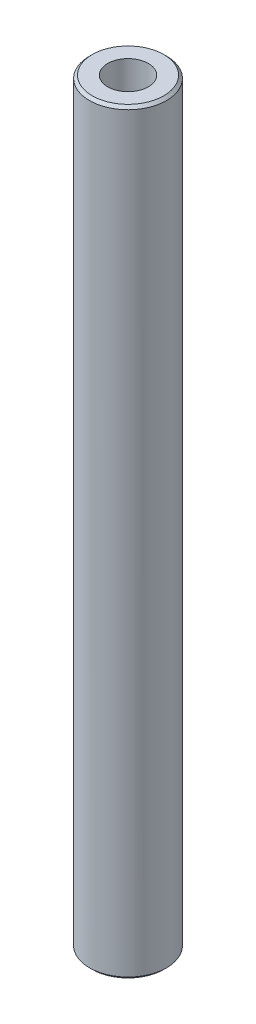
ISO-10303-21;
HEADER;
FILE_DESCRIPTION(('STEP AP214'),'2;1');
FILE_NAME('part.step','',(''),(''),'','','');
FILE_SCHEMA(('AUTOMOTIVE_DESIGN { 1 0 10303 214 1 1 1 1 }'));
ENDSEC;
DATA;
#1=APPLICATION_CONTEXT('core data for automotive mechanical design processes');
#2=APPLICATION_PROTOCOL_DEFINITION('international standard','automotive_design',2000,#1);
#3=PRODUCT_CONTEXT('',#1,'mechanical');
#4=PRODUCT('Part','Part','',(#3));
#5=PRODUCT_RELATED_PRODUCT_CATEGORY('part','',(#4));
#6=PRODUCT_DEFINITION_FORMATION('','',#4);
#7=PRODUCT_DEFINITION_CONTEXT('part definition',#1,'design');
#8=PRODUCT_DEFINITION('design','',#6,#7);
#9=PRODUCT_DEFINITION_SHAPE('','',#8);
#10=(LENGTH_UNIT() NAMED_UNIT(*) SI_UNIT(.MILLI.,.METRE.));
#11=(NAMED_UNIT(*) PLANE_ANGLE_UNIT() SI_UNIT($,.RADIAN.));
#12=(NAMED_UNIT(*) SI_UNIT($,.STERADIAN.) SOLID_ANGLE_UNIT());
#13=UNCERTAINTY_MEASURE_WITH_UNIT(LENGTH_MEASURE(1.E-05),#10,'distance_accuracy_value','');
#14=(GEOMETRIC_REPRESENTATION_CONTEXT(3) GLOBAL_UNCERTAINTY_ASSIGNED_CONTEXT((#13)) GLOBAL_UNIT_ASSIGNED_CONTEXT((#10,
#11,#12)) REPRESENTATION_CONTEXT('',''));
#15=CARTESIAN_POINT('',(0.,0.,0.));
#16=DIRECTION('',(0.,0.,1.));
#17=DIRECTION('',(1.,0.,0.));
#18=AXIS2_PLACEMENT_3D('',#15,#16,#17);
#19=CARTESIAN_POINT('',(0.,98.232856946647,0.));
#20=DIRECTION('',(0.,-1.,0.));
#21=DIRECTION('',(0.,0.,-1.));
#22=AXIS2_PLACEMENT_3D('',#19,#20,#21);
#23=CYLINDRICAL_SURFACE('',#22,5.);
#24=CARTESIAN_POINT('',(0.,97.8749158704361,0.));
#25=DIRECTION('',(0.,1.,0.));
#26=DIRECTION('',(0.,0.,1.));
#27=AXIS2_PLACEMENT_3D('',#24,#25,#26);
#28=CIRCLE('',#27,5.);
#29=CARTESIAN_POINT('',(0.,97.8749158704361,-5.));
#30=VERTEX_POINT('',#29);
#31=EDGE_CURVE('E50',#30,#30,#28,.F.);
#32=CARTESIAN_POINT('',(0.,0.357941076211024,0.));
#33=DIRECTION('',(0.,1.,0.));
#34=DIRECTION('',(0.,0.,1.));
#35=AXIS2_PLACEMENT_3D('',#32,#33,#34);
#36=CIRCLE('',#35,5.);
#37=CARTESIAN_POINT('',(0.,0.35794107621101,-5.));
#38=VERTEX_POINT('',#37);
#39=EDGE_CURVE('E51',#38,#38,#36,.T.);
#40=CARTESIAN_POINT('',(0.,97.8749158704361,-5.));
#41=CARTESIAN_POINT('',(0.,96.8591140496629,-5.));
#42=CARTESIAN_POINT('',(0.,95.8433122288897,-5.));
#43=CARTESIAN_POINT('',(0.,93.8117085873433,-5.));
#44=CARTESIAN_POINT('',(0.,92.7959067665702,-5.));
#45=CARTESIAN_POINT('',(0.,90.7643031250238,-5.));
#46=CARTESIAN_POINT('',(0.,89.7485013042507,-5.));
#47=CARTESIAN_POINT('',(0.,87.7168976627043,-5.));
#48=CARTESIAN_POINT('',(0.,86.7010958419311,-5.));
#49=CARTESIAN_POINT('',(0.,84.6694922003848,-5.));
#50=CARTESIAN_POINT('',(0.,83.6536903796116,-5.));
#51=CARTESIAN_POINT('',(0.,81.6220867380652,-5.));
#52=CARTESIAN_POINT('',(0.,80.606284917292,-5.));
#53=CARTESIAN_POINT('',(0.,78.5746812757457,-5.));
#54=CARTESIAN_POINT('',(0.,77.5588794549725,-5.));
#55=CARTESIAN_POINT('',(0.,75.5272758134261,-5.));
#56=CARTESIAN_POINT('',(0.,74.511473992653,-5.));
#57=CARTESIAN_POINT('',(0.,72.4798703511066,-5.));
#58=CARTESIAN_POINT('',(0.,71.4640685303334,-5.));
#59=CARTESIAN_POINT('',(0.,69.4324648887871,-5.));
#60=CARTESIAN_POINT('',(0.,68.4166630680139,-5.));
#61=CARTESIAN_POINT('',(0.,66.3850594264676,-5.));
#62=CARTESIAN_POINT('',(0.,65.3692576056944,-5.));
#63=CARTESIAN_POINT('',(0.,63.337653964148,-5.));
#64=CARTESIAN_POINT('',(0.,62.3218521433748,-5.));
#65=CARTESIAN_POINT('',(0.,60.2902485018285,-5.));
#66=CARTESIAN_POINT('',(0.,59.2744466810553,-5.));
#67=CARTESIAN_POINT('',(0.,57.242843039509,-5.));
#68=CARTESIAN_POINT('',(0.,56.2270412187358,-5.));
#69=CARTESIAN_POINT('',(0.,54.1954375771894,-5.));
#70=CARTESIAN_POINT('',(0.,53.1796357564162,-5.));
#71=CARTESIAN_POINT('',(0.,51.1480321148699,-5.));
#72=CARTESIAN_POINT('',(0.,50.1322302940967,-5.));
#73=CARTESIAN_POINT('',(0.,48.1006266525504,-5.));
#74=CARTESIAN_POINT('',(0.,47.0848248317772,-5.));
#75=CARTESIAN_POINT('',(0.,45.0532211902308,-5.));
#76=CARTESIAN_POINT('',(0.,44.0374193694576,-5.));
#77=CARTESIAN_POINT('',(0.,42.0058157279113,-5.));
#78=CARTESIAN_POINT('',(0.,40.9900139071381,-5.));
#79=CARTESIAN_POINT('',(0.,38.9584102655918,-5.));
#80=CARTESIAN_POINT('',(0.,37.9426084448186,-5.));
#81=CARTESIAN_POINT('',(0.,35.9110048032722,-5.));
#82=CARTESIAN_POINT('',(0.,34.8952029824991,-5.));
#83=CARTESIAN_POINT('',(0.,32.8635993409527,-5.));
#84=CARTESIAN_POINT('',(0.,31.8477975201795,-5.));
#85=CARTESIAN_POINT('',(0.,29.8161938786332,-5.));
#86=CARTESIAN_POINT('',(0.,28.80039205786,-5.));
#87=CARTESIAN_POINT('',(0.,26.7687884163136,-5.));
#88=CARTESIAN_POINT('',(0.,25.7529865955405,-5.));
#89=CARTESIAN_POINT('',(0.,23.7213829539941,-5.));
#90=CARTESIAN_POINT('',(0.,22.7055811332209,-5.));
#91=CARTESIAN_POINT('',(0.,20.6739774916746,-5.));
#92=CARTESIAN_POINT('',(0.,19.6581756709014,-5.));
#93=CARTESIAN_POINT('',(0.,17.626572029355,-5.));
#94=CARTESIAN_POINT('',(0.,16.6107702085818,-5.));
#95=CARTESIAN_POINT('',(0.,14.5791665670355,-5.));
#96=CARTESIAN_POINT('',(0.,13.5633647462623,-5.));
#97=CARTESIAN_POINT('',(0.,11.531761104716,-5.));
#98=CARTESIAN_POINT('',(0.,10.5159592839428,-5.));
#99=CARTESIAN_POINT('',(0.,8.48435564239642,-5.));
#100=CARTESIAN_POINT('',(0.,7.46855382162325,-5.));
#101=CARTESIAN_POINT('',(0.,5.43695018007689,-5.));
#102=CARTESIAN_POINT('',(0.,4.42114835930371,-5.));
#103=CARTESIAN_POINT('',(0.,2.38954471775736,-5.));
#104=CARTESIAN_POINT('',(0.,1.37374289698418,-5.));
#105=CARTESIAN_POINT('',(0.,0.35794107621101,-5.));
#106=B_SPLINE_CURVE_WITH_KNOTS('',3,(#40,#41,#42,#43,#44,#45,#46,#47,#48,#49,#50,#51,#52,#53,
#54,#55,#56,#57,#58,#59,#60,#61,#62,#63,#64,#65,#66,#67,#68,#69,#70,#71,#72,#73,#74,#75,#76,#77,
#78,#79,#80,#81,#82,#83,#84,#85,#86,#87,#88,#89,#90,#91,#92,#93,#94,#95,#96,#97,#98,#99,#100,
#101,#102,#103,#104,#105),.UNSPECIFIED.,.F.,.F.,(4,2,2,2,2,2,2,2,2,2,2,2,2,2,2,2,2,2,2,2,2,2,2,
2,2,2,2,2,2,2,2,2,4),(0.,3.04740546231955,6.09481092463908,9.14221638695861,12.1896218492781,
15.2370273115977,18.2844327739172,21.3318382362367,24.3792436985563,27.4266491608758,
30.4740546231953,33.5214600855149,36.5688655478344,39.6162710101539,42.6636764724735,
45.711081934793,48.7584873971125,51.8058928594321,54.8532983217516,57.9007037840711,
60.9481092463907,63.9955147087102,67.0429201710297,70.0903256333493,73.1377310956688,
76.1851365579883,79.2325420203079,82.2799474826274,85.3273529449469,88.3747584072665,
91.422163869586,94.4695693319055,97.5169747942251),.UNSPECIFIED.);
#107=EDGE_CURVE('BSEAM39',#30,#38,#106,.T.);
#108=ORIENTED_EDGE('',*,*,#31,.T.);
#109=ORIENTED_EDGE('',*,*,#39,.T.);
#110=ORIENTED_EDGE('',*,*,#107,.T.);
#111=ORIENTED_EDGE('',*,*,#107,.F.);
#112=EDGE_LOOP('',(#108,#110,#109,#111));
#113=FACE_BOUND('',#112,.T.);
#114=ADVANCED_FACE('F39',(#113),#23,.T.);
#115=CARTESIAN_POINT('',(0.,98.232856946647,0.));
#116=DIRECTION('',(0.,1.,0.));
#117=DIRECTION('',(0.,0.,1.));
#118=AXIS2_PLACEMENT_3D('',#115,#116,#117);
#119=PLANE('',#118);
#120=CARTESIAN_POINT('',(0.,98.232856946647,0.));
#121=DIRECTION('',(0.,1.,0.));
#122=DIRECTION('',(0.,0.,1.));
#123=AXIS2_PLACEMENT_3D('',#120,#121,#122);
#124=CIRCLE('',#123,4.6420589237891);
#125=CARTESIAN_POINT('',(0.,98.232856946647,4.6420589237891));
#126=VERTEX_POINT('',#125);
#127=EDGE_CURVE('E54',#126,#126,#124,.T.);
#128=ORIENTED_EDGE('',*,*,#127,.T.);
#129=EDGE_LOOP('',(#128));
#130=FACE_BOUND('',#129,.T.);
#131=CARTESIAN_POINT('',(0.,98.232856946647,0.));
#132=DIRECTION('',(0.,1.,0.));
#133=DIRECTION('',(0.,0.,1.));
#134=AXIS2_PLACEMENT_3D('',#131,#132,#133);
#135=CIRCLE('',#134,2.6361337810057);
#136=CARTESIAN_POINT('',(0.,98.232856946647,-2.6361337810057));
#137=VERTEX_POINT('',#136);
#138=EDGE_CURVE('E58',#137,#137,#135,.T.);
#139=ORIENTED_EDGE('',*,*,#138,.F.);
#140=EDGE_LOOP('',(#139));
#141=FACE_BOUND('',#140,.T.);
#142=ADVANCED_FACE('F69',(#130,#141),#119,.T.);
#143=CARTESIAN_POINT('',(0.,0.,0.));
#144=DIRECTION('',(0.,1.,0.));
#145=DIRECTION('',(0.,0.,1.));
#146=AXIS2_PLACEMENT_3D('',#143,#144,#145);
#147=PLANE('',#146);
#148=CARTESIAN_POINT('',(0.,0.,0.));
#149=DIRECTION('',(0.,1.,0.));
#150=DIRECTION('',(0.,0.,1.));
#151=AXIS2_PLACEMENT_3D('',#148,#149,#150);
#152=CIRCLE('',#151,4.64205892378897);
#153=CARTESIAN_POINT('',(0.,0.,4.64205892378897));
#154=VERTEX_POINT('',#153);
#155=EDGE_CURVE('E10',#154,#154,#152,.F.);
#156=ORIENTED_EDGE('',*,*,#155,.T.);
#157=EDGE_LOOP('',(#156));
#158=FACE_BOUND('',#157,.T.);
#159=CARTESIAN_POINT('',(0.,0.,0.));
#160=DIRECTION('',(0.,1.,0.));
#161=DIRECTION('',(0.,0.,1.));
#162=AXIS2_PLACEMENT_3D('',#159,#160,#161);
#163=CIRCLE('',#162,2.6361337810057);
#164=CARTESIAN_POINT('',(0.,0.,-2.6361337810057));
#165=VERTEX_POINT('',#164);
#166=EDGE_CURVE('E63',#165,#165,#163,.T.);
#167=ORIENTED_EDGE('',*,*,#166,.T.);
#168=EDGE_LOOP('',(#167));
#169=FACE_BOUND('',#168,.T.);
#170=ADVANCED_FACE('F75',(#158,#169),#147,.F.);
#171=CARTESIAN_POINT('',(0.,98.232856946647,0.));
#172=DIRECTION('',(0.,-1.,0.));
#173=DIRECTION('',(0.,0.,-1.));
#174=AXIS2_PLACEMENT_3D('',#171,#172,#173);
#175=CYLINDRICAL_SURFACE('',#174,2.6361337810057);
#176=CARTESIAN_POINT('',(0.,98.232856946647,-2.6361337810057));
#177=CARTESIAN_POINT('',(0.,97.2095980201194,-2.6361337810057));
#178=CARTESIAN_POINT('',(0.,96.1863390935918,-2.6361337810057));
#179=CARTESIAN_POINT('',(0.,94.1398212405367,-2.6361337810057));
#180=CARTESIAN_POINT('',(0.,93.1165623140091,-2.6361337810057));
#181=CARTESIAN_POINT('',(0.,91.070044460954,-2.6361337810057));
#182=CARTESIAN_POINT('',(0.,90.0467855344264,-2.6361337810057));
#183=CARTESIAN_POINT('',(0.,88.0002676813712,-2.6361337810057));
#184=CARTESIAN_POINT('',(0.,86.9770087548437,-2.6361337810057));
#185=CARTESIAN_POINT('',(0.,84.9304909017885,-2.6361337810057));
#186=CARTESIAN_POINT('',(0.,83.907231975261,-2.6361337810057));
#187=CARTESIAN_POINT('',(0.,81.8607141222058,-2.6361337810057));
#188=CARTESIAN_POINT('',(0.,80.8374551956782,-2.6361337810057));
#189=CARTESIAN_POINT('',(0.,78.7909373426231,-2.6361337810057));
#190=CARTESIAN_POINT('',(0.,77.7676784160955,-2.6361337810057));
#191=CARTESIAN_POINT('',(0.,75.7211605630404,-2.6361337810057));
#192=CARTESIAN_POINT('',(0.,74.6979016365128,-2.6361337810057));
#193=CARTESIAN_POINT('',(0.,72.6513837834576,-2.6361337810057));
#194=CARTESIAN_POINT('',(0.,71.6281248569301,-2.6361337810057));
#195=CARTESIAN_POINT('',(0.,69.5816070038749,-2.6361337810057));
#196=CARTESIAN_POINT('',(0.,68.5583480773474,-2.6361337810057));
#197=CARTESIAN_POINT('',(0.,66.5118302242922,-2.6361337810057));
#198=CARTESIAN_POINT('',(0.,65.4885712977646,-2.6361337810057));
#199=CARTESIAN_POINT('',(0.,63.4420534447095,-2.6361337810057));
#200=CARTESIAN_POINT('',(0.,62.4187945181819,-2.6361337810057));
#201=CARTESIAN_POINT('',(0.,60.3722766651268,-2.6361337810057));
#202=CARTESIAN_POINT('',(0.,59.3490177385992,-2.6361337810057));
#203=CARTESIAN_POINT('',(0.,57.3024998855441,-2.6361337810057));
#204=CARTESIAN_POINT('',(0.,56.2792409590165,-2.6361337810057));
#205=CARTESIAN_POINT('',(0.,54.2327231059613,-2.6361337810057));
#206=CARTESIAN_POINT('',(0.,53.2094641794338,-2.6361337810057));
#207=CARTESIAN_POINT('',(0.,51.1629463263786,-2.6361337810057));
#208=CARTESIAN_POINT('',(0.,50.1396873998511,-2.6361337810057));
#209=CARTESIAN_POINT('',(0.,48.0931695467959,-2.6361337810057));
#210=CARTESIAN_POINT('',(0.,47.0699106202683,-2.6361337810057));
#211=CARTESIAN_POINT('',(0.,45.0233927672132,-2.6361337810057));
#212=CARTESIAN_POINT('',(0.,44.0001338406856,-2.6361337810057));
#213=CARTESIAN_POINT('',(0.,41.9536159876305,-2.6361337810057));
#214=CARTESIAN_POINT('',(0.,40.9303570611029,-2.6361337810057));
#215=CARTESIAN_POINT('',(0.,38.8838392080478,-2.6361337810057));
#216=CARTESIAN_POINT('',(0.,37.8605802815202,-2.6361337810057));
#217=CARTESIAN_POINT('',(0.,35.814062428465,-2.6361337810057));
#218=CARTESIAN_POINT('',(0.,34.7908035019375,-2.6361337810057));
#219=CARTESIAN_POINT('',(0.,32.7442856488823,-2.6361337810057));
#220=CARTESIAN_POINT('',(0.,31.7210267223548,-2.6361337810057));
#221=CARTESIAN_POINT('',(0.,29.6745088692996,-2.6361337810057));
#222=CARTESIAN_POINT('',(0.,28.651249942772,-2.6361337810057));
#223=CARTESIAN_POINT('',(0.,26.6047320897169,-2.6361337810057));
#224=CARTESIAN_POINT('',(0.,25.5814731631893,-2.6361337810057));
#225=CARTESIAN_POINT('',(0.,23.5349553101342,-2.6361337810057));
#226=CARTESIAN_POINT('',(0.,22.5116963836066,-2.6361337810057));
#227=CARTESIAN_POINT('',(0.,20.4651785305515,-2.6361337810057));
#228=CARTESIAN_POINT('',(0.,19.4419196040239,-2.6361337810057));
#229=CARTESIAN_POINT('',(0.,17.3954017509687,-2.6361337810057));
#230=CARTESIAN_POINT('',(0.,16.3721428244412,-2.6361337810057));
#231=CARTESIAN_POINT('',(0.,14.325624971386,-2.6361337810057));
#232=CARTESIAN_POINT('',(0.,13.3023660448584,-2.6361337810057));
#233=CARTESIAN_POINT('',(0.,11.2558481918033,-2.6361337810057));
#234=CARTESIAN_POINT('',(0.,10.2325892652757,-2.6361337810057));
#235=CARTESIAN_POINT('',(0.,8.18607141222058,-2.6361337810057));
#236=CARTESIAN_POINT('',(0.,7.16281248569301,-2.6361337810057));
#237=CARTESIAN_POINT('',(0.,5.11629463263787,-2.6361337810057));
#238=CARTESIAN_POINT('',(0.,4.09303570611029,-2.6361337810057));
#239=CARTESIAN_POINT('',(0.,2.04651785305514,-2.6361337810057));
#240=CARTESIAN_POINT('',(0.,1.02325892652757,-2.6361337810057));
#241=CARTESIAN_POINT('',(0.,0.,-2.6361337810057));
#242=B_SPLINE_CURVE_WITH_KNOTS('',3,(#176,#177,#178,#179,#180,#181,#182,#183,#184,#185,#186,
#187,#188,#189,#190,#191,#192,#193,#194,#195,#196,#197,#198,#199,#200,#201,#202,#203,#204,#205,
#206,#207,#208,#209,#210,#211,#212,#213,#214,#215,#216,#217,#218,#219,#220,#221,#222,#223,#224,
#225,#226,#227,#228,#229,#230,#231,#232,#233,#234,#235,#236,#237,#238,#239,#240,#241),
.UNSPECIFIED.,.F.,.F.,(4,2,2,2,2,2,2,2,2,2,2,2,2,2,2,2,2,2,2,2,2,2,2,2,2,2,2,2,2,2,2,2,4),(0.,
3.06977677958273,6.13955355916544,9.20933033874816,12.2791071183309,15.3488838979136,
18.4186606774963,21.488437457079,24.5582142366618,27.6279910162445,30.6977677958272,
33.7675445754099,36.8373213549926,39.9070981345753,42.9768749141581,46.0466516937408,
49.1164284733235,52.1862052529062,55.2559820324889,58.3257588120717,61.3955355916544,
64.4653123712371,67.5350891508198,70.6048659304025,73.6746427099852,76.7444194895679,
79.8141962691507,82.8839730487334,85.9537498283161,89.0235266078988,92.0933033874815,
95.1630801670643,98.232856946647),.UNSPECIFIED.);
#243=EDGE_CURVE('BSEAM70',#137,#165,#242,.T.);
#244=ORIENTED_EDGE('',*,*,#138,.T.);
#245=ORIENTED_EDGE('',*,*,#166,.F.);
#246=ORIENTED_EDGE('',*,*,#243,.T.);
#247=ORIENTED_EDGE('',*,*,#243,.F.);
#248=EDGE_LOOP('',(#244,#246,#245,#247));
#249=FACE_BOUND('',#248,.T.);
#250=ADVANCED_FACE('F70',(#249),#175,.F.);
#251=CARTESIAN_POINT('',(0.,98.232856946647,0.));
#252=DIRECTION('',(0.,-1.,0.));
#253=DIRECTION('',(0.,0.,-1.));
#254=AXIS2_PLACEMENT_3D('',#251,#252,#253);
#255=CONICAL_SURFACE('',#254,4.6420589237891,0.785398163397443);
#256=ORIENTED_EDGE('',*,*,#31,.F.);
#257=EDGE_LOOP('',(#256));
#258=FACE_BOUND('',#257,.T.);
#259=ORIENTED_EDGE('',*,*,#127,.F.);
#260=EDGE_LOOP('',(#259));
#261=FACE_BOUND('',#260,.T.);
#262=ADVANCED_FACE('F81',(#258,#261),#255,.T.);
#263=CARTESIAN_POINT('',(0.,0.357941076211024,0.));
#264=DIRECTION('',(0.,1.,0.));
#265=DIRECTION('',(0.,0.,1.));
#266=AXIS2_PLACEMENT_3D('',#263,#264,#265);
#267=CONICAL_SURFACE('',#266,5.,0.785398163397463);
#268=ORIENTED_EDGE('',*,*,#155,.F.);
#269=EDGE_LOOP('',(#268));
#270=FACE_BOUND('',#269,.T.);
#271=ORIENTED_EDGE('',*,*,#39,.F.);
#272=EDGE_LOOP('',(#271));
#273=FACE_BOUND('',#272,.T.);
#274=ADVANCED_FACE('F45',(#270,#273),#267,.T.);
#275=CLOSED_SHELL('',(#114,#142,#170,#250,#262,#274));
#276=MANIFOLD_SOLID_BREP('B2',#275);
#277=ADVANCED_BREP_SHAPE_REPRESENTATION('',(#18,#276),#14);
#278=SHAPE_DEFINITION_REPRESENTATION(#9,#277);
ENDSEC;
END-ISO-10303-21;
